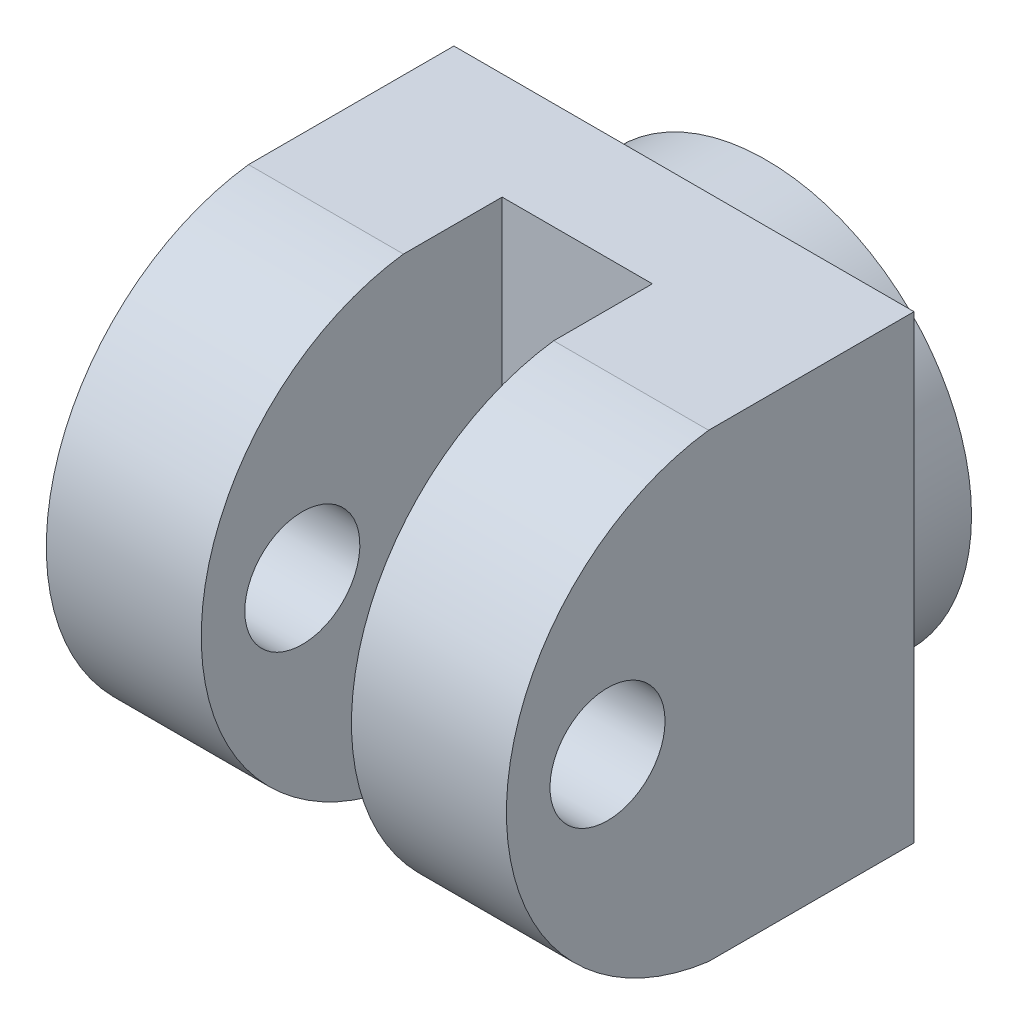
ISO-10303-21;
HEADER;
FILE_DESCRIPTION(('STEP AP214'),'2;1');
FILE_NAME('part.step','',(''),(''),'','','');
FILE_SCHEMA(('AUTOMOTIVE_DESIGN { 1 0 10303 214 1 1 1 1 }'));
ENDSEC;
DATA;
#1=APPLICATION_CONTEXT('core data for automotive mechanical design processes');
#2=APPLICATION_PROTOCOL_DEFINITION('international standard','automotive_design',2000,#1);
#3=PRODUCT_CONTEXT('',#1,'mechanical');
#4=PRODUCT('Part','Part','',(#3));
#5=PRODUCT_RELATED_PRODUCT_CATEGORY('part','',(#4));
#6=PRODUCT_DEFINITION_FORMATION('','',#4);
#7=PRODUCT_DEFINITION_CONTEXT('part definition',#1,'design');
#8=PRODUCT_DEFINITION('design','',#6,#7);
#9=PRODUCT_DEFINITION_SHAPE('','',#8);
#10=(LENGTH_UNIT() NAMED_UNIT(*) SI_UNIT(.MILLI.,.METRE.));
#11=(NAMED_UNIT(*) PLANE_ANGLE_UNIT() SI_UNIT($,.RADIAN.));
#12=(NAMED_UNIT(*) SI_UNIT($,.STERADIAN.) SOLID_ANGLE_UNIT());
#13=UNCERTAINTY_MEASURE_WITH_UNIT(LENGTH_MEASURE(1.E-05),#10,'distance_accuracy_value','');
#14=(GEOMETRIC_REPRESENTATION_CONTEXT(3) GLOBAL_UNCERTAINTY_ASSIGNED_CONTEXT((#13)) GLOBAL_UNIT_ASSIGNED_CONTEXT((#10,
#11,#12)) REPRESENTATION_CONTEXT('',''));
#15=CARTESIAN_POINT('',(0.,0.,0.));
#16=DIRECTION('',(0.,0.,1.));
#17=DIRECTION('',(1.,0.,0.));
#18=AXIS2_PLACEMENT_3D('',#15,#16,#17);
#19=CARTESIAN_POINT('',(14.,0.,15.6878592758979));
#20=DIRECTION('',(-1.,0.,0.));
#21=DIRECTION('',(0.,-1.,0.));
#22=AXIS2_PLACEMENT_3D('',#19,#20,#21);
#23=CYLINDRICAL_SURFACE('',#22,14.1167933329049);
#24=DIRECTION('',(-1.,0.,0.));
#25=VECTOR('',#24,1.);
#26=CARTESIAN_POINT('',(14.,14.,17.5));
#27=LINE('',#26,#25);
#28=CARTESIAN_POINT('',(14.,14.,17.5));
#29=VERTEX_POINT('',#28);
#30=CARTESIAN_POINT('',(4.57099999478532,14.,17.5));
#31=VERTEX_POINT('',#30);
#32=EDGE_CURVE('E133',#29,#31,#27,.T.);
#33=ORIENTED_EDGE('',*,*,#32,.T.);
#34=CARTESIAN_POINT('',(4.57099999478532,0.,15.6878592758979));
#35=DIRECTION('',(1.,0.,0.));
#36=DIRECTION('',(0.,0.,-1.));
#37=AXIS2_PLACEMENT_3D('',#34,#35,#36);
#38=CIRCLE('',#37,14.1167933329049);
#39=CARTESIAN_POINT('',(4.57099999478532,-14.,17.5));
#40=VERTEX_POINT('',#39);
#41=EDGE_CURVE('E42',#31,#40,#38,.T.);
#42=ORIENTED_EDGE('',*,*,#41,.T.);
#43=DIRECTION('',(-1.,0.,0.));
#44=VECTOR('',#43,1.);
#45=CARTESIAN_POINT('',(14.,-14.,17.5));
#46=LINE('',#45,#44);
#47=CARTESIAN_POINT('',(14.,-14.,17.5));
#48=VERTEX_POINT('',#47);
#49=EDGE_CURVE('E137',#48,#40,#46,.T.);
#50=ORIENTED_EDGE('',*,*,#49,.F.);
#51=CARTESIAN_POINT('',(14.,0.,15.6878592758979));
#52=DIRECTION('',(1.,0.,0.));
#53=DIRECTION('',(0.,1.,0.));
#54=AXIS2_PLACEMENT_3D('',#51,#52,#53);
#55=CIRCLE('',#54,14.1167933329049);
#56=EDGE_CURVE('E129',#29,#48,#55,.T.);
#57=ORIENTED_EDGE('',*,*,#56,.F.);
#58=EDGE_LOOP('',(#33,#42,#50,#57));
#59=FACE_BOUND('',#58,.T.);
#60=ADVANCED_FACE('F33',(#59),#23,.T.);
#61=CARTESIAN_POINT('',(0.,0.,0.));
#62=DIRECTION('',(0.,0.,1.));
#63=DIRECTION('',(1.,0.,0.));
#64=AXIS2_PLACEMENT_3D('',#61,#62,#63);
#65=PLANE('',#64);
#66=CARTESIAN_POINT('',(0.,0.,0.));
#67=DIRECTION('',(0.,0.,1.));
#68=DIRECTION('',(1.,0.,0.));
#69=AXIS2_PLACEMENT_3D('',#66,#67,#68);
#70=CIRCLE('',#69,12.5);
#71=CARTESIAN_POINT('',(12.5,0.,0.));
#72=VERTEX_POINT('',#71);
#73=EDGE_CURVE('E165',#72,#72,#70,.T.);
#74=ORIENTED_EDGE('',*,*,#73,.F.);
#75=EDGE_LOOP('',(#74));
#76=FACE_BOUND('',#75,.T.);
#77=CARTESIAN_POINT('',(0.,0.,0.));
#78=DIRECTION('',(0.,0.,1.));
#79=DIRECTION('',(1.,0.,0.));
#80=AXIS2_PLACEMENT_3D('',#77,#78,#79);
#81=CIRCLE('',#80,10.);
#82=CARTESIAN_POINT('',(10.,0.,0.));
#83=VERTEX_POINT('',#82);
#84=EDGE_CURVE('E162',#83,#83,#81,.T.);
#85=ORIENTED_EDGE('',*,*,#84,.T.);
#86=EDGE_LOOP('',(#85));
#87=FACE_BOUND('',#86,.T.);
#88=ADVANCED_FACE('F201',(#76,#87),#65,.F.);
#89=CARTESIAN_POINT('',(0.,0.,5.));
#90=DIRECTION('',(0.,0.,-1.));
#91=DIRECTION('',(-1.,0.,0.));
#92=AXIS2_PLACEMENT_3D('',#89,#90,#91);
#93=CYLINDRICAL_SURFACE('',#92,12.5);
#94=CARTESIAN_POINT('',(0.,0.,5.));
#95=DIRECTION('',(0.,0.,1.));
#96=DIRECTION('',(1.,0.,0.));
#97=AXIS2_PLACEMENT_3D('',#94,#95,#96);
#98=CIRCLE('',#97,12.5);
#99=CARTESIAN_POINT('',(12.5,0.,5.));
#100=VERTEX_POINT('',#99);
#101=EDGE_CURVE('E166',#100,#100,#98,.T.);
#102=ORIENTED_EDGE('',*,*,#101,.F.);
#103=EDGE_LOOP('',(#102));
#104=FACE_BOUND('',#103,.T.);
#105=ORIENTED_EDGE('',*,*,#73,.T.);
#106=EDGE_LOOP('',(#105));
#107=FACE_BOUND('',#106,.T.);
#108=ADVANCED_FACE('F35',(#104,#107),#93,.T.);
#109=CARTESIAN_POINT('',(0.,0.,5.));
#110=DIRECTION('',(0.,0.,-1.));
#111=DIRECTION('',(-1.,0.,0.));
#112=AXIS2_PLACEMENT_3D('',#109,#110,#111);
#113=CYLINDRICAL_SURFACE('',#112,10.);
#114=CARTESIAN_POINT('',(0.,0.,5.));
#115=DIRECTION('',(0.,0.,1.));
#116=DIRECTION('',(1.,0.,0.));
#117=AXIS2_PLACEMENT_3D('',#114,#115,#116);
#118=CIRCLE('',#117,10.);
#119=CARTESIAN_POINT('',(10.,0.,5.));
#120=VERTEX_POINT('',#119);
#121=EDGE_CURVE('E159',#120,#120,#118,.T.);
#122=ORIENTED_EDGE('',*,*,#121,.T.);
#123=EDGE_LOOP('',(#122));
#124=FACE_BOUND('',#123,.T.);
#125=ORIENTED_EDGE('',*,*,#84,.F.);
#126=EDGE_LOOP('',(#125));
#127=FACE_BOUND('',#126,.T.);
#128=ADVANCED_FACE('F235',(#124,#127),#113,.F.);
#129=CARTESIAN_POINT('',(0.,0.,5.));
#130=DIRECTION('',(0.,0.,1.));
#131=DIRECTION('',(1.,0.,0.));
#132=AXIS2_PLACEMENT_3D('',#129,#130,#131);
#133=PLANE('',#132);
#134=ORIENTED_EDGE('',*,*,#121,.F.);
#135=EDGE_LOOP('',(#134));
#136=FACE_BOUND('',#135,.T.);
#137=ADVANCED_FACE('F214',(#136),#133,.F.);
#138=CARTESIAN_POINT('',(14.,14.,30.));
#139=DIRECTION('',(-1.,0.,0.));
#140=DIRECTION('',(0.,-1.,0.));
#141=AXIS2_PLACEMENT_3D('',#138,#139,#140);
#142=PLANE('',#141);
#143=CARTESIAN_POINT('',(14.,0.,23.6523263044014));
#144=DIRECTION('',(-1.,0.,0.));
#145=DIRECTION('',(0.,-1.,0.));
#146=AXIS2_PLACEMENT_3D('',#143,#144,#145);
#147=CIRCLE('',#146,3.5);
#148=CARTESIAN_POINT('',(14.,-3.49999999999999,23.6523263044014));
#149=VERTEX_POINT('',#148);
#150=EDGE_CURVE('E119',#149,#149,#147,.T.);
#151=ORIENTED_EDGE('',*,*,#150,.T.);
#152=EDGE_LOOP('',(#151));
#153=FACE_BOUND('',#152,.T.);
#154=DIRECTION('',(0.,0.,-1.));
#155=VECTOR('',#154,1.);
#156=CARTESIAN_POINT('',(14.,14.,30.));
#157=LINE('',#156,#155);
#158=CARTESIAN_POINT('',(14.,14.,5.));
#159=VERTEX_POINT('',#158);
#160=EDGE_CURVE('E157',#29,#159,#157,.T.);
#161=ORIENTED_EDGE('',*,*,#160,.F.);
#162=ORIENTED_EDGE('',*,*,#56,.T.);
#163=DIRECTION('',(0.,0.,-1.));
#164=VECTOR('',#163,1.);
#165=CARTESIAN_POINT('',(14.,-14.,30.));
#166=LINE('',#165,#164);
#167=CARTESIAN_POINT('',(14.,-14.,5.));
#168=VERTEX_POINT('',#167);
#169=EDGE_CURVE('E151',#48,#168,#166,.T.);
#170=ORIENTED_EDGE('',*,*,#169,.T.);
#171=DIRECTION('',(0.,1.,0.));
#172=VECTOR('',#171,1.);
#173=CARTESIAN_POINT('',(14.,14.,5.));
#174=LINE('',#173,#172);
#175=EDGE_CURVE('E136',#168,#159,#174,.T.);
#176=ORIENTED_EDGE('',*,*,#175,.T.);
#177=EDGE_LOOP('',(#161,#162,#170,#176));
#178=FACE_BOUND('',#177,.T.);
#179=ADVANCED_FACE('F183',(#153,#178),#142,.F.);
#180=CARTESIAN_POINT('',(-14.,14.,30.));
#181=DIRECTION('',(0.,-1.,0.));
#182=DIRECTION('',(0.,0.,-1.));
#183=AXIS2_PLACEMENT_3D('',#180,#181,#182);
#184=PLANE('',#183);
#185=DIRECTION('',(1.,0.,0.));
#186=VECTOR('',#185,1.);
#187=CARTESIAN_POINT('',(-4.57099999478532,14.,11.4951327101993));
#188=LINE('',#187,#186);
#189=CARTESIAN_POINT('',(-4.57099999478532,14.,11.4951327101993));
#190=VERTEX_POINT('',#189);
#191=CARTESIAN_POINT('',(4.57099999478532,14.,11.4951327101993));
#192=VERTEX_POINT('',#191);
#193=EDGE_CURVE('E104',#190,#192,#188,.T.);
#194=ORIENTED_EDGE('',*,*,#193,.T.);
#195=DIRECTION('',(0.,0.,1.));
#196=VECTOR('',#195,1.);
#197=CARTESIAN_POINT('',(4.57099999478532,14.,30.91176985619));
#198=LINE('',#197,#196);
#199=EDGE_CURVE('E117',#192,#31,#198,.T.);
#200=ORIENTED_EDGE('',*,*,#199,.T.);
#201=ORIENTED_EDGE('',*,*,#32,.F.);
#202=ORIENTED_EDGE('',*,*,#160,.T.);
#203=DIRECTION('',(-1.,0.,0.));
#204=VECTOR('',#203,1.);
#205=CARTESIAN_POINT('',(-14.,14.,5.));
#206=LINE('',#205,#204);
#207=CARTESIAN_POINT('',(-14.,14.,5.));
#208=VERTEX_POINT('',#207);
#209=EDGE_CURVE('E142',#159,#208,#206,.T.);
#210=ORIENTED_EDGE('',*,*,#209,.T.);
#211=DIRECTION('',(0.,0.,-1.));
#212=VECTOR('',#211,1.);
#213=CARTESIAN_POINT('',(-14.,14.,30.));
#214=LINE('',#213,#212);
#215=CARTESIAN_POINT('',(-14.,14.,17.5));
#216=VERTEX_POINT('',#215);
#217=EDGE_CURVE('E155',#216,#208,#214,.T.);
#218=ORIENTED_EDGE('',*,*,#217,.F.);
#219=CARTESIAN_POINT('',(-4.57099999478532,14.,17.5));
#220=VERTEX_POINT('',#219);
#221=EDGE_CURVE('E116',#220,#216,#27,.T.);
#222=ORIENTED_EDGE('',*,*,#221,.F.);
#223=DIRECTION('',(0.,0.,-1.));
#224=VECTOR('',#223,1.);
#225=CARTESIAN_POINT('',(-4.57099999478532,14.,30.91176985619));
#226=LINE('',#225,#224);
#227=EDGE_CURVE('E49',#220,#190,#226,.T.);
#228=ORIENTED_EDGE('',*,*,#227,.T.);
#229=EDGE_LOOP('',(#194,#200,#201,#202,#210,#218,#222,#228));
#230=FACE_BOUND('',#229,.T.);
#231=ADVANCED_FACE('F114',(#230),#184,.F.);
#232=CARTESIAN_POINT('',(-14.,14.,30.));
#233=DIRECTION('',(1.,0.,0.));
#234=DIRECTION('',(0.,1.,0.));
#235=AXIS2_PLACEMENT_3D('',#232,#233,#234);
#236=PLANE('',#235);
#237=CARTESIAN_POINT('',(-14.,0.,23.6523263044014));
#238=DIRECTION('',(1.,0.,0.));
#239=DIRECTION('',(0.,1.,0.));
#240=AXIS2_PLACEMENT_3D('',#237,#238,#239);
#241=CIRCLE('',#240,3.5);
#242=CARTESIAN_POINT('',(-14.,3.5,23.6523263044014));
#243=VERTEX_POINT('',#242);
#244=EDGE_CURVE('E344',#243,#243,#241,.T.);
#245=ORIENTED_EDGE('',*,*,#244,.T.);
#246=EDGE_LOOP('',(#245));
#247=FACE_BOUND('',#246,.T.);
#248=DIRECTION('',(0.,0.,-1.));
#249=VECTOR('',#248,1.);
#250=CARTESIAN_POINT('',(-14.,-14.,30.));
#251=LINE('',#250,#249);
#252=CARTESIAN_POINT('',(-14.,-14.,17.5));
#253=VERTEX_POINT('',#252);
#254=CARTESIAN_POINT('',(-14.,-14.,5.));
#255=VERTEX_POINT('',#254);
#256=EDGE_CURVE('E153',#253,#255,#251,.T.);
#257=ORIENTED_EDGE('',*,*,#256,.F.);
#258=CARTESIAN_POINT('',(-14.,0.,15.6878592758979));
#259=DIRECTION('',(1.,0.,0.));
#260=DIRECTION('',(0.,1.,0.));
#261=AXIS2_PLACEMENT_3D('',#258,#259,#260);
#262=CIRCLE('',#261,14.1167933329049);
#263=EDGE_CURVE('E128',#216,#253,#262,.T.);
#264=ORIENTED_EDGE('',*,*,#263,.F.);
#265=ORIENTED_EDGE('',*,*,#217,.T.);
#266=DIRECTION('',(0.,-1.,0.));
#267=VECTOR('',#266,1.);
#268=CARTESIAN_POINT('',(-14.,14.,5.));
#269=LINE('',#268,#267);
#270=EDGE_CURVE('E145',#208,#255,#269,.T.);
#271=ORIENTED_EDGE('',*,*,#270,.T.);
#272=EDGE_LOOP('',(#257,#264,#265,#271));
#273=FACE_BOUND('',#272,.T.);
#274=ADVANCED_FACE('F218',(#247,#273),#236,.F.);
#275=CARTESIAN_POINT('',(-14.,-14.,30.));
#276=DIRECTION('',(0.,1.,0.));
#277=DIRECTION('',(0.,0.,1.));
#278=AXIS2_PLACEMENT_3D('',#275,#276,#277);
#279=PLANE('',#278);
#280=ORIENTED_EDGE('',*,*,#49,.T.);
#281=DIRECTION('',(0.,0.,-1.));
#282=VECTOR('',#281,1.);
#283=CARTESIAN_POINT('',(4.57099999478532,-14.,30.));
#284=LINE('',#283,#282);
#285=CARTESIAN_POINT('',(4.57099999478532,-14.,11.4951327101993));
#286=VERTEX_POINT('',#285);
#287=EDGE_CURVE('E125',#40,#286,#284,.T.);
#288=ORIENTED_EDGE('',*,*,#287,.T.);
#289=DIRECTION('',(-1.,0.,0.));
#290=VECTOR('',#289,1.);
#291=CARTESIAN_POINT('',(-14.,-14.,11.4951327101993));
#292=LINE('',#291,#290);
#293=CARTESIAN_POINT('',(-4.57099999478532,-14.,11.4951327101993));
#294=VERTEX_POINT('',#293);
#295=EDGE_CURVE('E11',#286,#294,#292,.T.);
#296=ORIENTED_EDGE('',*,*,#295,.T.);
#297=DIRECTION('',(0.,0.,1.));
#298=VECTOR('',#297,1.);
#299=CARTESIAN_POINT('',(-4.57099999478532,-14.,30.));
#300=LINE('',#299,#298);
#301=CARTESIAN_POINT('',(-4.57099999478532,-14.,17.5));
#302=VERTEX_POINT('',#301);
#303=EDGE_CURVE('E101',#294,#302,#300,.T.);
#304=ORIENTED_EDGE('',*,*,#303,.T.);
#305=EDGE_CURVE('E57',#302,#253,#46,.T.);
#306=ORIENTED_EDGE('',*,*,#305,.T.);
#307=ORIENTED_EDGE('',*,*,#256,.T.);
#308=DIRECTION('',(1.,0.,0.));
#309=VECTOR('',#308,1.);
#310=CARTESIAN_POINT('',(-14.,-14.,5.));
#311=LINE('',#310,#309);
#312=EDGE_CURVE('E148',#255,#168,#311,.T.);
#313=ORIENTED_EDGE('',*,*,#312,.T.);
#314=ORIENTED_EDGE('',*,*,#169,.F.);
#315=EDGE_LOOP('',(#280,#288,#296,#304,#306,#307,#313,#314));
#316=FACE_BOUND('',#315,.T.);
#317=ADVANCED_FACE('F178',(#316),#279,.F.);
#318=ORIENTED_EDGE('',*,*,#101,.T.);
#319=EDGE_LOOP('',(#318));
#320=FACE_BOUND('',#319,.T.);
#321=ORIENTED_EDGE('',*,*,#175,.F.);
#322=ORIENTED_EDGE('',*,*,#312,.F.);
#323=ORIENTED_EDGE('',*,*,#270,.F.);
#324=ORIENTED_EDGE('',*,*,#209,.F.);
#325=EDGE_LOOP('',(#321,#322,#323,#324));
#326=FACE_BOUND('',#325,.T.);
#327=ADVANCED_FACE('F208',(#320,#326),#133,.F.);
#328=ORIENTED_EDGE('',*,*,#305,.F.);
#329=CARTESIAN_POINT('',(-4.57099999478532,0.,15.6878592758979));
#330=DIRECTION('',(-1.,0.,0.));
#331=DIRECTION('',(0.,0.,1.));
#332=AXIS2_PLACEMENT_3D('',#329,#330,#331);
#333=CIRCLE('',#332,14.1167933329049);
#334=EDGE_CURVE('E169',#302,#220,#333,.T.);
#335=ORIENTED_EDGE('',*,*,#334,.T.);
#336=ORIENTED_EDGE('',*,*,#221,.T.);
#337=ORIENTED_EDGE('',*,*,#263,.T.);
#338=EDGE_LOOP('',(#328,#335,#336,#337));
#339=FACE_BOUND('',#338,.T.);
#340=ADVANCED_FACE('F196',(#339),#23,.T.);
#341=CARTESIAN_POINT('',(-4.57099999478532,14.,11.4951327101993));
#342=DIRECTION('',(0.,0.,-1.));
#343=DIRECTION('',(-1.,0.,0.));
#344=AXIS2_PLACEMENT_3D('',#341,#342,#343);
#345=PLANE('',#344);
#346=DIRECTION('',(0.,-1.,0.));
#347=VECTOR('',#346,1.);
#348=CARTESIAN_POINT('',(4.57099999478532,14.,11.4951327101993));
#349=LINE('',#348,#347);
#350=EDGE_CURVE('E103',#192,#286,#349,.T.);
#351=ORIENTED_EDGE('',*,*,#350,.F.);
#352=ORIENTED_EDGE('',*,*,#193,.F.);
#353=DIRECTION('',(0.,-1.,0.));
#354=VECTOR('',#353,1.);
#355=CARTESIAN_POINT('',(-4.57099999478532,14.,11.4951327101993));
#356=LINE('',#355,#354);
#357=EDGE_CURVE('E98',#190,#294,#356,.T.);
#358=ORIENTED_EDGE('',*,*,#357,.T.);
#359=ORIENTED_EDGE('',*,*,#295,.F.);
#360=EDGE_LOOP('',(#351,#352,#358,#359));
#361=FACE_BOUND('',#360,.T.);
#362=ADVANCED_FACE('F107',(#361),#345,.F.);
#363=CARTESIAN_POINT('',(4.57099999478532,14.,30.91176985619));
#364=DIRECTION('',(1.,0.,0.));
#365=DIRECTION('',(0.,0.,-1.));
#366=AXIS2_PLACEMENT_3D('',#363,#364,#365);
#367=PLANE('',#366);
#368=CARTESIAN_POINT('',(4.57099999478532,0.,23.6523263044014));
#369=DIRECTION('',(1.,0.,0.));
#370=DIRECTION('',(0.,0.,-1.));
#371=AXIS2_PLACEMENT_3D('',#368,#369,#370);
#372=CIRCLE('',#371,3.5);
#373=CARTESIAN_POINT('',(4.57099999478532,0.,20.1523263044014));
#374=VERTEX_POINT('',#373);
#375=EDGE_CURVE('E339',#374,#374,#372,.T.);
#376=ORIENTED_EDGE('',*,*,#375,.T.);
#377=EDGE_LOOP('',(#376));
#378=FACE_BOUND('',#377,.T.);
#379=ORIENTED_EDGE('',*,*,#41,.F.);
#380=ORIENTED_EDGE('',*,*,#199,.F.);
#381=ORIENTED_EDGE('',*,*,#350,.T.);
#382=ORIENTED_EDGE('',*,*,#287,.F.);
#383=EDGE_LOOP('',(#379,#380,#381,#382));
#384=FACE_BOUND('',#383,.T.);
#385=ADVANCED_FACE('F185',(#378,#384),#367,.F.);
#386=CARTESIAN_POINT('',(-4.57099999478532,14.,30.91176985619));
#387=DIRECTION('',(-1.,0.,0.));
#388=DIRECTION('',(0.,0.,1.));
#389=AXIS2_PLACEMENT_3D('',#386,#387,#388);
#390=PLANE('',#389);
#391=CARTESIAN_POINT('',(-4.57099999478532,0.,23.6523263044014));
#392=DIRECTION('',(-1.,0.,0.));
#393=DIRECTION('',(0.,0.,1.));
#394=AXIS2_PLACEMENT_3D('',#391,#392,#393);
#395=CIRCLE('',#394,3.5);
#396=CARTESIAN_POINT('',(-4.57099999478532,0.,27.1523263044014));
#397=VERTEX_POINT('',#396);
#398=EDGE_CURVE('E37',#397,#397,#395,.T.);
#399=ORIENTED_EDGE('',*,*,#398,.T.);
#400=EDGE_LOOP('',(#399));
#401=FACE_BOUND('',#400,.T.);
#402=ORIENTED_EDGE('',*,*,#357,.F.);
#403=ORIENTED_EDGE('',*,*,#227,.F.);
#404=ORIENTED_EDGE('',*,*,#334,.F.);
#405=ORIENTED_EDGE('',*,*,#303,.F.);
#406=EDGE_LOOP('',(#402,#403,#404,#405));
#407=FACE_BOUND('',#406,.T.);
#408=ADVANCED_FACE('F100',(#401,#407),#390,.F.);
#409=CARTESIAN_POINT('',(-14.,0.,23.6523263044014));
#410=DIRECTION('',(1.,0.,0.));
#411=DIRECTION('',(0.,1.,0.));
#412=AXIS2_PLACEMENT_3D('',#409,#410,#411);
#413=CYLINDRICAL_SURFACE('',#412,3.5);
#414=ORIENTED_EDGE('',*,*,#244,.F.);
#415=EDGE_LOOP('',(#414));
#416=FACE_BOUND('',#415,.T.);
#417=ORIENTED_EDGE('',*,*,#398,.F.);
#418=EDGE_LOOP('',(#417));
#419=FACE_BOUND('',#418,.T.);
#420=ADVANCED_FACE('F193',(#416,#419),#413,.F.);
#421=ORIENTED_EDGE('',*,*,#375,.F.);
#422=EDGE_LOOP('',(#421));
#423=FACE_BOUND('',#422,.T.);
#424=ORIENTED_EDGE('',*,*,#150,.F.);
#425=EDGE_LOOP('',(#424));
#426=FACE_BOUND('',#425,.T.);
#427=ADVANCED_FACE('F324',(#423,#426),#413,.F.);
#428=CLOSED_SHELL('',(#60,#88,#108,#128,#137,#179,#231,#274,#317,#327,#340,#362,#385,#408,#420,#427));
#429=MANIFOLD_SOLID_BREP('B2',#428);
#430=ADVANCED_BREP_SHAPE_REPRESENTATION('',(#18,#429),#14);
#431=SHAPE_DEFINITION_REPRESENTATION(#9,#430);
ENDSEC;
END-ISO-10303-21;
